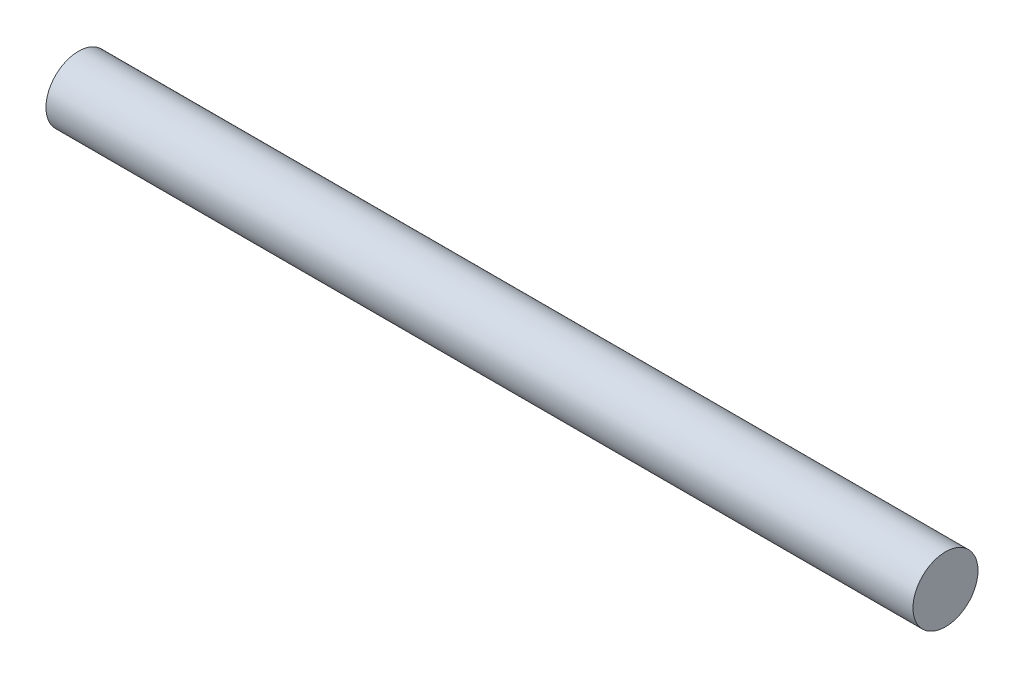
ISO-10303-21;
HEADER;
FILE_DESCRIPTION(('STEP AP214'),'2;1');
FILE_NAME('part.step','',(''),(''),'','','');
FILE_SCHEMA(('AUTOMOTIVE_DESIGN { 1 0 10303 214 1 1 1 1 }'));
ENDSEC;
DATA;
#1=APPLICATION_CONTEXT('core data for automotive mechanical design processes');
#2=APPLICATION_PROTOCOL_DEFINITION('international standard','automotive_design',2000,#1);
#3=PRODUCT_CONTEXT('',#1,'mechanical');
#4=PRODUCT('Part','Part','',(#3));
#5=PRODUCT_RELATED_PRODUCT_CATEGORY('part','',(#4));
#6=PRODUCT_DEFINITION_FORMATION('','',#4);
#7=PRODUCT_DEFINITION_CONTEXT('part definition',#1,'design');
#8=PRODUCT_DEFINITION('design','',#6,#7);
#9=PRODUCT_DEFINITION_SHAPE('','',#8);
#10=(LENGTH_UNIT() NAMED_UNIT(*) SI_UNIT(.MILLI.,.METRE.));
#11=(NAMED_UNIT(*) PLANE_ANGLE_UNIT() SI_UNIT($,.RADIAN.));
#12=(NAMED_UNIT(*) SI_UNIT($,.STERADIAN.) SOLID_ANGLE_UNIT());
#13=UNCERTAINTY_MEASURE_WITH_UNIT(LENGTH_MEASURE(1.E-05),#10,'distance_accuracy_value','');
#14=(GEOMETRIC_REPRESENTATION_CONTEXT(3) GLOBAL_UNCERTAINTY_ASSIGNED_CONTEXT((#13)) GLOBAL_UNIT_ASSIGNED_CONTEXT((#10,
#11,#12)) REPRESENTATION_CONTEXT('',''));
#15=CARTESIAN_POINT('',(0.,0.,0.));
#16=DIRECTION('',(0.,0.,1.));
#17=DIRECTION('',(1.,0.,0.));
#18=AXIS2_PLACEMENT_3D('',#15,#16,#17);
#19=CARTESIAN_POINT('',(127.,0.,0.));
#20=DIRECTION('',(-1.,0.,0.));
#21=DIRECTION('',(0.,0.,1.));
#22=AXIS2_PLACEMENT_3D('',#19,#20,#21);
#23=CYLINDRICAL_SURFACE('',#22,4.7625);
#24=CARTESIAN_POINT('',(127.,0.,0.));
#25=DIRECTION('',(1.,0.,0.));
#26=DIRECTION('',(0.,0.,-1.));
#27=AXIS2_PLACEMENT_3D('',#24,#25,#26);
#28=CIRCLE('',#27,4.7625);
#29=CARTESIAN_POINT('',(127.,0.,-4.7625));
#30=VERTEX_POINT('',#29);
#31=EDGE_CURVE('E10',#30,#30,#28,.T.);
#32=ORIENTED_EDGE('',*,*,#31,.F.);
#33=EDGE_LOOP('',(#32));
#34=FACE_BOUND('',#33,.T.);
#35=CARTESIAN_POINT('',(0.,0.,0.));
#36=DIRECTION('',(1.,0.,0.));
#37=DIRECTION('',(0.,0.,-1.));
#38=AXIS2_PLACEMENT_3D('',#35,#36,#37);
#39=CIRCLE('',#38,4.7625);
#40=CARTESIAN_POINT('',(0.,0.,-4.7625));
#41=VERTEX_POINT('',#40);
#42=EDGE_CURVE('E33',#41,#41,#39,.T.);
#43=ORIENTED_EDGE('',*,*,#42,.T.);
#44=EDGE_LOOP('',(#43));
#45=FACE_BOUND('',#44,.T.);
#46=ADVANCED_FACE('F30',(#34,#45),#23,.T.);
#47=CARTESIAN_POINT('',(127.,0.,0.));
#48=DIRECTION('',(1.,0.,0.));
#49=DIRECTION('',(0.,0.,-1.));
#50=AXIS2_PLACEMENT_3D('',#47,#48,#49);
#51=PLANE('',#50);
#52=ORIENTED_EDGE('',*,*,#31,.T.);
#53=EDGE_LOOP('',(#52));
#54=FACE_BOUND('',#53,.T.);
#55=ADVANCED_FACE('F45',(#54),#51,.T.);
#56=CARTESIAN_POINT('',(0.,0.,0.));
#57=DIRECTION('',(1.,0.,0.));
#58=DIRECTION('',(0.,0.,-1.));
#59=AXIS2_PLACEMENT_3D('',#56,#57,#58);
#60=PLANE('',#59);
#61=ORIENTED_EDGE('',*,*,#42,.F.);
#62=EDGE_LOOP('',(#61));
#63=FACE_BOUND('',#62,.T.);
#64=ADVANCED_FACE('F43',(#63),#60,.F.);
#65=CLOSED_SHELL('',(#46,#55,#64));
#66=MANIFOLD_SOLID_BREP('B2',#65);
#67=ADVANCED_BREP_SHAPE_REPRESENTATION('',(#18,#66),#14);
#68=SHAPE_DEFINITION_REPRESENTATION(#9,#67);
ENDSEC;
END-ISO-10303-21;
